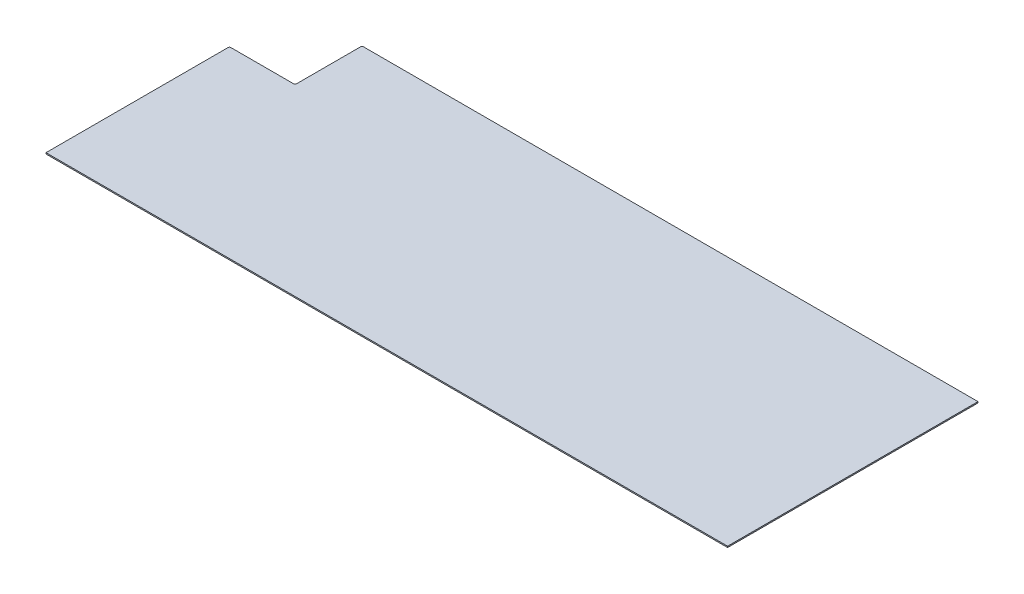
ISO-10303-21;
HEADER;
FILE_DESCRIPTION(('STEP AP214'),'2;1');
FILE_NAME('part.step','',(''),(''),'','','');
FILE_SCHEMA(('AUTOMOTIVE_DESIGN { 1 0 10303 214 1 1 1 1 }'));
ENDSEC;
DATA;
#1=APPLICATION_CONTEXT('core data for automotive mechanical design processes');
#2=APPLICATION_PROTOCOL_DEFINITION('international standard','automotive_design',2000,#1);
#3=PRODUCT_CONTEXT('',#1,'mechanical');
#4=PRODUCT('Part','Part','',(#3));
#5=PRODUCT_RELATED_PRODUCT_CATEGORY('part','',(#4));
#6=PRODUCT_DEFINITION_FORMATION('','',#4);
#7=PRODUCT_DEFINITION_CONTEXT('part definition',#1,'design');
#8=PRODUCT_DEFINITION('design','',#6,#7);
#9=PRODUCT_DEFINITION_SHAPE('','',#8);
#10=(LENGTH_UNIT() NAMED_UNIT(*) SI_UNIT(.MILLI.,.METRE.));
#11=(NAMED_UNIT(*) PLANE_ANGLE_UNIT() SI_UNIT($,.RADIAN.));
#12=(NAMED_UNIT(*) SI_UNIT($,.STERADIAN.) SOLID_ANGLE_UNIT());
#13=UNCERTAINTY_MEASURE_WITH_UNIT(LENGTH_MEASURE(1.E-05),#10,'distance_accuracy_value','');
#14=(GEOMETRIC_REPRESENTATION_CONTEXT(3) GLOBAL_UNCERTAINTY_ASSIGNED_CONTEXT((#13)) GLOBAL_UNIT_ASSIGNED_CONTEXT((#10,
#11,#12)) REPRESENTATION_CONTEXT('',''));
#15=CARTESIAN_POINT('',(0.,0.,0.));
#16=DIRECTION('',(0.,0.,1.));
#17=DIRECTION('',(1.,0.,0.));
#18=AXIS2_PLACEMENT_3D('',#15,#16,#17);
#19=CARTESIAN_POINT('',(0.,2.921,0.));
#20=DIRECTION('',(1.,0.,0.));
#21=DIRECTION('',(0.,0.,-1.));
#22=AXIS2_PLACEMENT_3D('',#19,#20,#21);
#23=PLANE('',#22);
#24=DIRECTION('',(0.,0.,1.));
#25=VECTOR('',#24,1.);
#26=CARTESIAN_POINT('',(0.,0.,0.));
#27=LINE('',#26,#25);
#28=CARTESIAN_POINT('',(0.,0.,-431.8));
#29=VERTEX_POINT('',#28);
#30=CARTESIAN_POINT('',(0.,0.,0.));
#31=VERTEX_POINT('',#30);
#32=EDGE_CURVE('E135',#29,#31,#27,.T.);
#33=ORIENTED_EDGE('',*,*,#32,.T.);
#34=DIRECTION('',(0.,-1.,0.));
#35=VECTOR('',#34,1.);
#36=CARTESIAN_POINT('',(0.,2.921,0.));
#37=LINE('',#36,#35);
#38=CARTESIAN_POINT('',(0.,2.921,0.));
#39=VERTEX_POINT('',#38);
#40=EDGE_CURVE('E11',#39,#31,#37,.T.);
#41=ORIENTED_EDGE('',*,*,#40,.F.);
#42=DIRECTION('',(0.,0.,1.));
#43=VECTOR('',#42,1.);
#44=CARTESIAN_POINT('',(0.,2.921,0.));
#45=LINE('',#44,#43);
#46=CARTESIAN_POINT('',(0.,2.921,-431.8));
#47=VERTEX_POINT('',#46);
#48=EDGE_CURVE('E151',#47,#39,#45,.T.);
#49=ORIENTED_EDGE('',*,*,#48,.F.);
#50=DIRECTION('',(0.,-1.,0.));
#51=VECTOR('',#50,1.);
#52=CARTESIAN_POINT('',(0.,2.921,-431.8));
#53=LINE('',#52,#51);
#54=EDGE_CURVE('E131',#47,#29,#53,.T.);
#55=ORIENTED_EDGE('',*,*,#54,.T.);
#56=EDGE_LOOP('',(#33,#41,#49,#55));
#57=FACE_BOUND('',#56,.T.);
#58=ADVANCED_FACE('F33',(#57),#23,.F.);
#59=CARTESIAN_POINT('',(0.,2.921,0.));
#60=DIRECTION('',(0.,0.,-1.));
#61=DIRECTION('',(-1.,0.,0.));
#62=AXIS2_PLACEMENT_3D('',#59,#60,#61);
#63=PLANE('',#62);
#64=DIRECTION('',(1.,0.,0.));
#65=VECTOR('',#64,1.);
#66=CARTESIAN_POINT('',(0.,0.,0.));
#67=LINE('',#66,#65);
#68=CARTESIAN_POINT('',(1616.075,0.,0.));
#69=VERTEX_POINT('',#68);
#70=EDGE_CURVE('E138',#31,#69,#67,.T.);
#71=ORIENTED_EDGE('',*,*,#70,.T.);
#72=DIRECTION('',(0.,-1.,0.));
#73=VECTOR('',#72,1.);
#74=CARTESIAN_POINT('',(1616.075,2.921,0.));
#75=LINE('',#74,#73);
#76=CARTESIAN_POINT('',(1616.075,2.921,0.));
#77=VERTEX_POINT('',#76);
#78=EDGE_CURVE('E41',#77,#69,#75,.T.);
#79=ORIENTED_EDGE('',*,*,#78,.F.);
#80=DIRECTION('',(1.,0.,0.));
#81=VECTOR('',#80,1.);
#82=CARTESIAN_POINT('',(0.,2.921,0.));
#83=LINE('',#82,#81);
#84=EDGE_CURVE('E95',#39,#77,#83,.T.);
#85=ORIENTED_EDGE('',*,*,#84,.F.);
#86=ORIENTED_EDGE('',*,*,#40,.T.);
#87=EDGE_LOOP('',(#71,#79,#85,#86));
#88=FACE_BOUND('',#87,.T.);
#89=ADVANCED_FACE('F194',(#88),#63,.F.);
#90=CARTESIAN_POINT('',(1616.075,2.921,0.));
#91=DIRECTION('',(-1.,0.,0.));
#92=DIRECTION('',(0.,0.,1.));
#93=AXIS2_PLACEMENT_3D('',#90,#91,#92);
#94=PLANE('',#93);
#95=DIRECTION('',(0.,0.,-1.));
#96=VECTOR('',#95,1.);
#97=CARTESIAN_POINT('',(1616.075,0.,0.));
#98=LINE('',#97,#96);
#99=CARTESIAN_POINT('',(1616.075,0.,-593.725));
#100=VERTEX_POINT('',#99);
#101=EDGE_CURVE('E140',#69,#100,#98,.T.);
#102=ORIENTED_EDGE('',*,*,#101,.T.);
#103=DIRECTION('',(0.,-1.,0.));
#104=VECTOR('',#103,1.);
#105=CARTESIAN_POINT('',(1616.075,2.921,-593.725));
#106=LINE('',#105,#104);
#107=CARTESIAN_POINT('',(1616.075,2.921,-593.725));
#108=VERTEX_POINT('',#107);
#109=EDGE_CURVE('E161',#108,#100,#106,.T.);
#110=ORIENTED_EDGE('',*,*,#109,.F.);
#111=DIRECTION('',(0.,0.,-1.));
#112=VECTOR('',#111,1.);
#113=CARTESIAN_POINT('',(1616.075,2.921,0.));
#114=LINE('',#113,#112);
#115=EDGE_CURVE('E169',#77,#108,#114,.T.);
#116=ORIENTED_EDGE('',*,*,#115,.F.);
#117=ORIENTED_EDGE('',*,*,#78,.T.);
#118=EDGE_LOOP('',(#102,#110,#116,#117));
#119=FACE_BOUND('',#118,.T.);
#120=ADVANCED_FACE('F167',(#119),#94,.F.);
#121=CARTESIAN_POINT('',(158.75,2.921,-593.725));
#122=DIRECTION('',(0.,0.,1.));
#123=DIRECTION('',(1.,0.,0.));
#124=AXIS2_PLACEMENT_3D('',#121,#122,#123);
#125=PLANE('',#124);
#126=DIRECTION('',(-1.,0.,0.));
#127=VECTOR('',#126,1.);
#128=CARTESIAN_POINT('',(158.75,0.,-593.725));
#129=LINE('',#128,#127);
#130=CARTESIAN_POINT('',(158.75,0.,-593.725));
#131=VERTEX_POINT('',#130);
#132=EDGE_CURVE('E142',#100,#131,#129,.T.);
#133=ORIENTED_EDGE('',*,*,#132,.T.);
#134=DIRECTION('',(0.,-1.,0.));
#135=VECTOR('',#134,1.);
#136=CARTESIAN_POINT('',(158.75,2.921,-593.725));
#137=LINE('',#136,#135);
#138=CARTESIAN_POINT('',(158.75,2.921,-593.725));
#139=VERTEX_POINT('',#138);
#140=EDGE_CURVE('E158',#139,#131,#137,.T.);
#141=ORIENTED_EDGE('',*,*,#140,.F.);
#142=DIRECTION('',(-1.,0.,0.));
#143=VECTOR('',#142,1.);
#144=CARTESIAN_POINT('',(158.75,2.921,-593.725));
#145=LINE('',#144,#143);
#146=EDGE_CURVE('E185',#108,#139,#145,.T.);
#147=ORIENTED_EDGE('',*,*,#146,.F.);
#148=ORIENTED_EDGE('',*,*,#109,.T.);
#149=EDGE_LOOP('',(#133,#141,#147,#148));
#150=FACE_BOUND('',#149,.T.);
#151=ADVANCED_FACE('F178',(#150),#125,.F.);
#152=CARTESIAN_POINT('',(158.75,2.921,-590.55));
#153=DIRECTION('',(0.,-1.,0.));
#154=DIRECTION('',(0.,0.,-1.));
#155=AXIS2_PLACEMENT_3D('',#152,#153,#154);
#156=CYLINDRICAL_SURFACE('',#155,3.17500000000003);
#157=CARTESIAN_POINT('',(158.75,0.,-590.55));
#158=DIRECTION('',(0.,1.,0.));
#159=DIRECTION('',(0.,0.,-1.));
#160=AXIS2_PLACEMENT_3D('',#157,#158,#159);
#161=CIRCLE('',#160,3.17500000000003);
#162=CARTESIAN_POINT('',(155.575,0.,-590.55));
#163=VERTEX_POINT('',#162);
#164=EDGE_CURVE('E144',#131,#163,#161,.T.);
#165=ORIENTED_EDGE('',*,*,#164,.T.);
#166=DIRECTION('',(0.,-1.,0.));
#167=VECTOR('',#166,1.);
#168=CARTESIAN_POINT('',(155.575,2.921,-590.55));
#169=LINE('',#168,#167);
#170=CARTESIAN_POINT('',(155.575,2.921,-590.55));
#171=VERTEX_POINT('',#170);
#172=EDGE_CURVE('E155',#171,#163,#169,.T.);
#173=ORIENTED_EDGE('',*,*,#172,.F.);
#174=CARTESIAN_POINT('',(158.75,2.921,-590.55));
#175=DIRECTION('',(0.,1.,0.));
#176=DIRECTION('',(0.,0.,-1.));
#177=AXIS2_PLACEMENT_3D('',#174,#175,#176);
#178=CIRCLE('',#177,3.17500000000003);
#179=EDGE_CURVE('E184',#139,#171,#178,.T.);
#180=ORIENTED_EDGE('',*,*,#179,.F.);
#181=ORIENTED_EDGE('',*,*,#140,.T.);
#182=EDGE_LOOP('',(#165,#173,#180,#181));
#183=FACE_BOUND('',#182,.T.);
#184=ADVANCED_FACE('F182',(#183),#156,.T.);
#185=CARTESIAN_POINT('',(155.575,2.921,-438.15));
#186=DIRECTION('',(1.,0.,0.));
#187=DIRECTION('',(0.,0.,-1.));
#188=AXIS2_PLACEMENT_3D('',#185,#186,#187);
#189=PLANE('',#188);
#190=DIRECTION('',(0.,0.,1.));
#191=VECTOR('',#190,1.);
#192=CARTESIAN_POINT('',(155.575,0.,-438.15));
#193=LINE('',#192,#191);
#194=CARTESIAN_POINT('',(155.575,0.,-438.15));
#195=VERTEX_POINT('',#194);
#196=EDGE_CURVE('E146',#163,#195,#193,.T.);
#197=ORIENTED_EDGE('',*,*,#196,.T.);
#198=DIRECTION('',(0.,-1.,0.));
#199=VECTOR('',#198,1.);
#200=CARTESIAN_POINT('',(155.575,2.921,-438.15));
#201=LINE('',#200,#199);
#202=CARTESIAN_POINT('',(155.575,2.921,-438.15));
#203=VERTEX_POINT('',#202);
#204=EDGE_CURVE('E126',#203,#195,#201,.T.);
#205=ORIENTED_EDGE('',*,*,#204,.F.);
#206=DIRECTION('',(0.,0.,1.));
#207=VECTOR('',#206,1.);
#208=CARTESIAN_POINT('',(155.575,2.921,-438.15));
#209=LINE('',#208,#207);
#210=EDGE_CURVE('E117',#171,#203,#209,.T.);
#211=ORIENTED_EDGE('',*,*,#210,.F.);
#212=ORIENTED_EDGE('',*,*,#172,.T.);
#213=EDGE_LOOP('',(#197,#205,#211,#212));
#214=FACE_BOUND('',#213,.T.);
#215=ADVANCED_FACE('F206',(#214),#189,.F.);
#216=CARTESIAN_POINT('',(152.4,2.921,-438.15));
#217=DIRECTION('',(0.,-1.,0.));
#218=DIRECTION('',(0.,0.,-1.));
#219=AXIS2_PLACEMENT_3D('',#216,#217,#218);
#220=CYLINDRICAL_SURFACE('',#219,3.175);
#221=CARTESIAN_POINT('',(152.4,0.,-438.15));
#222=DIRECTION('',(0.,-1.,0.));
#223=DIRECTION('',(0.,0.,-1.));
#224=AXIS2_PLACEMENT_3D('',#221,#222,#223);
#225=CIRCLE('',#224,3.175);
#226=CARTESIAN_POINT('',(152.4,0.,-434.975));
#227=VERTEX_POINT('',#226);
#228=EDGE_CURVE('E125',#195,#227,#225,.T.);
#229=ORIENTED_EDGE('',*,*,#228,.T.);
#230=DIRECTION('',(0.,-1.,0.));
#231=VECTOR('',#230,1.);
#232=CARTESIAN_POINT('',(152.4,2.921,-434.975));
#233=LINE('',#232,#231);
#234=CARTESIAN_POINT('',(152.4,2.921,-434.975));
#235=VERTEX_POINT('',#234);
#236=EDGE_CURVE('E122',#235,#227,#233,.T.);
#237=ORIENTED_EDGE('',*,*,#236,.F.);
#238=CARTESIAN_POINT('',(152.4,2.921,-438.15));
#239=DIRECTION('',(0.,-1.,0.));
#240=DIRECTION('',(0.,0.,-1.));
#241=AXIS2_PLACEMENT_3D('',#238,#239,#240);
#242=CIRCLE('',#241,3.175);
#243=EDGE_CURVE('E111',#203,#235,#242,.T.);
#244=ORIENTED_EDGE('',*,*,#243,.F.);
#245=ORIENTED_EDGE('',*,*,#204,.T.);
#246=EDGE_LOOP('',(#229,#237,#244,#245));
#247=FACE_BOUND('',#246,.T.);
#248=ADVANCED_FACE('F123',(#247),#220,.F.);
#249=CARTESIAN_POINT('',(3.17500000000002,2.921,-434.975));
#250=DIRECTION('',(0.,0.,1.));
#251=DIRECTION('',(1.,0.,0.));
#252=AXIS2_PLACEMENT_3D('',#249,#250,#251);
#253=PLANE('',#252);
#254=DIRECTION('',(-1.,0.,0.));
#255=VECTOR('',#254,1.);
#256=CARTESIAN_POINT('',(3.17500000000002,0.,-434.975));
#257=LINE('',#256,#255);
#258=CARTESIAN_POINT('',(3.17500000000002,0.,-434.975));
#259=VERTEX_POINT('',#258);
#260=EDGE_CURVE('E81',#227,#259,#257,.T.);
#261=ORIENTED_EDGE('',*,*,#260,.T.);
#262=DIRECTION('',(0.,-1.,0.));
#263=VECTOR('',#262,1.);
#264=CARTESIAN_POINT('',(3.17500000000002,2.921,-434.975));
#265=LINE('',#264,#263);
#266=CARTESIAN_POINT('',(3.17500000000002,2.921,-434.975));
#267=VERTEX_POINT('',#266);
#268=EDGE_CURVE('E127',#267,#259,#265,.T.);
#269=ORIENTED_EDGE('',*,*,#268,.F.);
#270=DIRECTION('',(-1.,0.,0.));
#271=VECTOR('',#270,1.);
#272=CARTESIAN_POINT('',(3.17500000000002,2.921,-434.975));
#273=LINE('',#272,#271);
#274=EDGE_CURVE('E115',#235,#267,#273,.T.);
#275=ORIENTED_EDGE('',*,*,#274,.F.);
#276=ORIENTED_EDGE('',*,*,#236,.T.);
#277=EDGE_LOOP('',(#261,#269,#275,#276));
#278=FACE_BOUND('',#277,.T.);
#279=ADVANCED_FACE('F129',(#278),#253,.F.);
#280=CARTESIAN_POINT('',(3.175,2.921,-431.8));
#281=DIRECTION('',(0.,-1.,0.));
#282=DIRECTION('',(0.,0.,-1.));
#283=AXIS2_PLACEMENT_3D('',#280,#281,#282);
#284=CYLINDRICAL_SURFACE('',#283,3.17499999999999);
#285=CARTESIAN_POINT('',(3.175,0.,-431.8));
#286=DIRECTION('',(0.,1.,0.));
#287=DIRECTION('',(0.,0.,1.));
#288=AXIS2_PLACEMENT_3D('',#285,#286,#287);
#289=CIRCLE('',#288,3.17499999999999);
#290=EDGE_CURVE('E87',#259,#29,#289,.T.);
#291=ORIENTED_EDGE('',*,*,#290,.T.);
#292=ORIENTED_EDGE('',*,*,#54,.F.);
#293=CARTESIAN_POINT('',(3.175,2.921,-431.8));
#294=DIRECTION('',(0.,1.,0.));
#295=DIRECTION('',(0.,0.,1.));
#296=AXIS2_PLACEMENT_3D('',#293,#294,#295);
#297=CIRCLE('',#296,3.17499999999999);
#298=EDGE_CURVE('E49',#267,#47,#297,.T.);
#299=ORIENTED_EDGE('',*,*,#298,.F.);
#300=ORIENTED_EDGE('',*,*,#268,.T.);
#301=EDGE_LOOP('',(#291,#292,#299,#300));
#302=FACE_BOUND('',#301,.T.);
#303=ADVANCED_FACE('F214',(#302),#284,.T.);
#304=CARTESIAN_POINT('',(3.175,2.921,-431.8));
#305=DIRECTION('',(0.,1.,0.));
#306=DIRECTION('',(0.,0.,1.));
#307=AXIS2_PLACEMENT_3D('',#304,#305,#306);
#308=PLANE('',#307);
#309=ORIENTED_EDGE('',*,*,#48,.T.);
#310=ORIENTED_EDGE('',*,*,#84,.T.);
#311=ORIENTED_EDGE('',*,*,#115,.T.);
#312=ORIENTED_EDGE('',*,*,#146,.T.);
#313=ORIENTED_EDGE('',*,*,#179,.T.);
#314=ORIENTED_EDGE('',*,*,#210,.T.);
#315=ORIENTED_EDGE('',*,*,#243,.T.);
#316=ORIENTED_EDGE('',*,*,#274,.T.);
#317=ORIENTED_EDGE('',*,*,#298,.T.);
#318=EDGE_LOOP('',(#309,#310,#311,#312,#313,#314,#315,#316,#317));
#319=FACE_BOUND('',#318,.T.);
#320=ADVANCED_FACE('F113',(#319),#308,.T.);
#321=CARTESIAN_POINT('',(3.175,0.,-431.8));
#322=DIRECTION('',(0.,1.,0.));
#323=DIRECTION('',(0.,0.,1.));
#324=AXIS2_PLACEMENT_3D('',#321,#322,#323);
#325=PLANE('',#324);
#326=ORIENTED_EDGE('',*,*,#32,.F.);
#327=ORIENTED_EDGE('',*,*,#290,.F.);
#328=ORIENTED_EDGE('',*,*,#260,.F.);
#329=ORIENTED_EDGE('',*,*,#228,.F.);
#330=ORIENTED_EDGE('',*,*,#196,.F.);
#331=ORIENTED_EDGE('',*,*,#164,.F.);
#332=ORIENTED_EDGE('',*,*,#132,.F.);
#333=ORIENTED_EDGE('',*,*,#101,.F.);
#334=ORIENTED_EDGE('',*,*,#70,.F.);
#335=EDGE_LOOP('',(#326,#327,#328,#329,#330,#331,#332,#333,#334));
#336=FACE_BOUND('',#335,.T.);
#337=ADVANCED_FACE('F173',(#336),#325,.F.);
#338=CLOSED_SHELL('',(#58,#89,#120,#151,#184,#215,#248,#279,#303,#320,#337));
#339=MANIFOLD_SOLID_BREP('B2',#338);
#340=ADVANCED_BREP_SHAPE_REPRESENTATION('',(#18,#339),#14);
#341=SHAPE_DEFINITION_REPRESENTATION(#9,#340);
ENDSEC;
END-ISO-10303-21;
